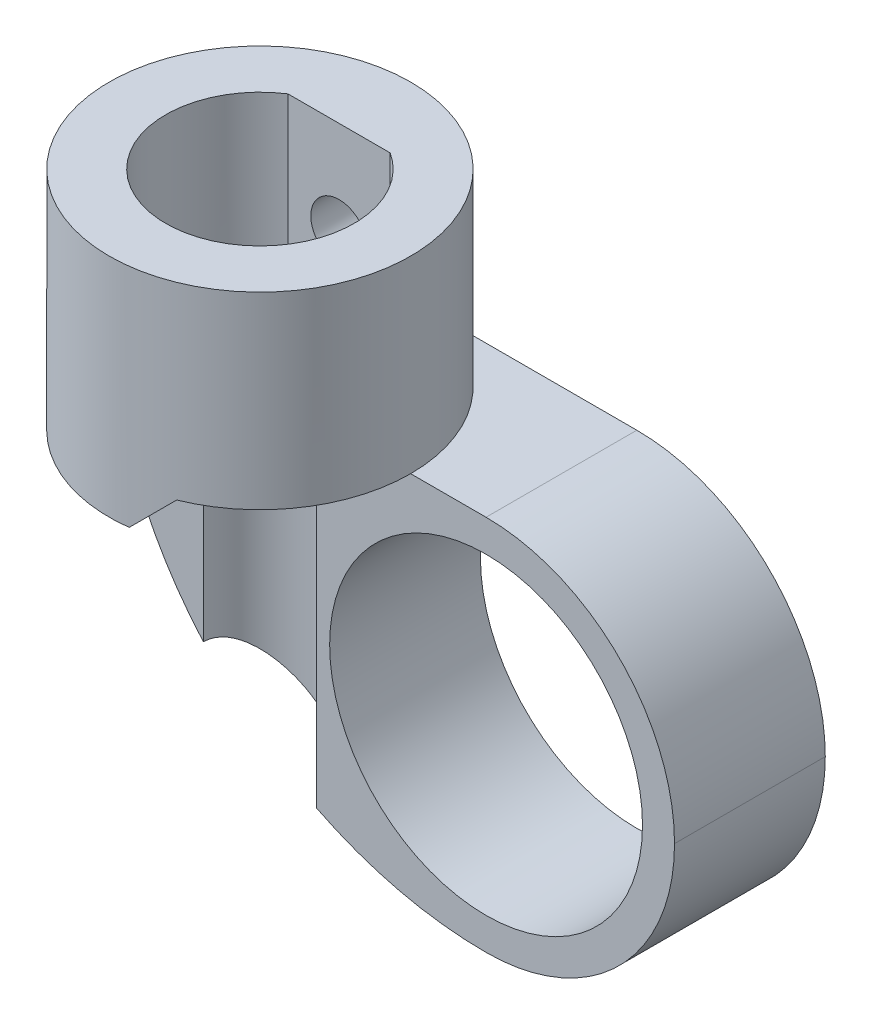
ISO-10303-21;
HEADER;
FILE_DESCRIPTION(('STEP AP214'),'2;1');
FILE_NAME('part.step','',(''),(''),'','','');
FILE_SCHEMA(('AUTOMOTIVE_DESIGN { 1 0 10303 214 1 1 1 1 }'));
ENDSEC;
DATA;
#1=APPLICATION_CONTEXT('core data for automotive mechanical design processes');
#2=APPLICATION_PROTOCOL_DEFINITION('international standard','automotive_design',2000,#1);
#3=PRODUCT_CONTEXT('',#1,'mechanical');
#4=PRODUCT('Part','Part','',(#3));
#5=PRODUCT_RELATED_PRODUCT_CATEGORY('part','',(#4));
#6=PRODUCT_DEFINITION_FORMATION('','',#4);
#7=PRODUCT_DEFINITION_CONTEXT('part definition',#1,'design');
#8=PRODUCT_DEFINITION('design','',#6,#7);
#9=PRODUCT_DEFINITION_SHAPE('','',#8);
#10=(LENGTH_UNIT() NAMED_UNIT(*) SI_UNIT(.MILLI.,.METRE.));
#11=(NAMED_UNIT(*) PLANE_ANGLE_UNIT() SI_UNIT($,.RADIAN.));
#12=(NAMED_UNIT(*) SI_UNIT($,.STERADIAN.) SOLID_ANGLE_UNIT());
#13=UNCERTAINTY_MEASURE_WITH_UNIT(LENGTH_MEASURE(1.E-05),#10,'distance_accuracy_value','');
#14=(GEOMETRIC_REPRESENTATION_CONTEXT(3) GLOBAL_UNCERTAINTY_ASSIGNED_CONTEXT((#13)) GLOBAL_UNIT_ASSIGNED_CONTEXT((#10,
#11,#12)) REPRESENTATION_CONTEXT('',''));
#15=CARTESIAN_POINT('',(0.,0.,0.));
#16=DIRECTION('',(0.,0.,1.));
#17=DIRECTION('',(1.,0.,0.));
#18=AXIS2_PLACEMENT_3D('',#15,#16,#17);
#19=CARTESIAN_POINT('',(0.,6.,0.));
#20=DIRECTION('',(0.,-1.,0.));
#21=DIRECTION('',(0.,0.,-1.));
#22=AXIS2_PLACEMENT_3D('',#19,#20,#21);
#23=CYLINDRICAL_SURFACE('',#22,4.);
#24=CARTESIAN_POINT('',(0.,-6.,0.));
#25=DIRECTION('',(0.,1.,0.));
#26=DIRECTION('',(0.,0.,1.));
#27=AXIS2_PLACEMENT_3D('',#24,#25,#26);
#28=CIRCLE('',#27,4.);
#29=CARTESIAN_POINT('',(-3.9498743710662,-6.,0.631262586246322));
#30=VERTEX_POINT('',#29);
#31=CARTESIAN_POINT('',(0.499999999999999,-6.,3.96862696659689));
#32=VERTEX_POINT('',#31);
#33=EDGE_CURVE('E193',#30,#32,#28,.T.);
#34=ORIENTED_EDGE('',*,*,#33,.T.);
#35=CARTESIAN_POINT('',(0.,-6.5,0.));
#36=DIRECTION('',(0.707106781186546,-0.707106781186549,0.));
#37=DIRECTION('',(-0.707106781186549,-0.707106781186546,0.));
#38=AXIS2_PLACEMENT_3D('',#35,#36,#37);
#39=ELLIPSE('',#38,5.65685424949237,4.);
#40=CARTESIAN_POINT('',(1.5,-5.,3.70809924354783));
#41=VERTEX_POINT('',#40);
#42=EDGE_CURVE('E11',#32,#41,#39,.F.);
#43=ORIENTED_EDGE('',*,*,#42,.T.);
#44=CARTESIAN_POINT('',(0.,-5.,0.));
#45=DIRECTION('',(0.,1.,0.));
#46=DIRECTION('',(0.,0.,1.));
#47=AXIS2_PLACEMENT_3D('',#44,#45,#46);
#48=CIRCLE('',#47,4.);
#49=CARTESIAN_POINT('',(4.,-5.,0.));
#50=VERTEX_POINT('',#49);
#51=EDGE_CURVE('E140',#41,#50,#48,.T.);
#52=ORIENTED_EDGE('',*,*,#51,.T.);
#53=CARTESIAN_POINT('',(0.,-5.,0.));
#54=DIRECTION('',(0.,1.,0.));
#55=DIRECTION('',(-1.,0.,0.));
#56=AXIS2_PLACEMENT_3D('',#53,#54,#55);
#57=CIRCLE('',#56,4.);
#58=CARTESIAN_POINT('',(0.,-5.,-4.));
#59=VERTEX_POINT('',#58);
#60=EDGE_CURVE('E153',#50,#59,#57,.T.);
#61=ORIENTED_EDGE('',*,*,#60,.T.);
#62=DIRECTION('',(0.,1.,0.));
#63=VECTOR('',#62,1.);
#64=CARTESIAN_POINT('',(0.,-15.,-4.));
#65=LINE('',#64,#63);
#66=CARTESIAN_POINT('',(0.,-13.,-4.));
#67=VERTEX_POINT('',#66);
#68=EDGE_CURVE('E338',#67,#59,#65,.T.);
#69=ORIENTED_EDGE('',*,*,#68,.F.);
#70=CARTESIAN_POINT('',(0.,-13.,-4.));
#71=CARTESIAN_POINT('',(-0.136828142349664,-12.8974163205105,-3.9999865045483));
#72=CARTESIAN_POINT('',(-0.270883349009088,-12.7913558223817,-3.99298316514078));
#73=CARTESIAN_POINT('',(-0.532473742800878,-12.573345536025,-3.96657821674277));
#74=CARTESIAN_POINT('',(-0.660019795246987,-12.4614062401594,-3.9471980508367));
#75=CARTESIAN_POINT('',(-0.906916734491149,-12.2334307682533,-3.89784569202083));
#76=CARTESIAN_POINT('',(-1.02633399292208,-12.1174436459312,-3.86797592672533));
#77=CARTESIAN_POINT('',(-1.2579962205929,-11.8810530718573,-3.79895536855165));
#78=CARTESIAN_POINT('',(-1.37023693747521,-11.7606470670557,-3.75979913664154));
#79=CARTESIAN_POINT('',(-1.63335273219341,-11.4642196545002,-3.65511218402422));
#80=CARTESIAN_POINT('',(-1.78042089668579,-11.2862713975695,-3.58543920262987));
#81=CARTESIAN_POINT('',(-2.05941788108904,-10.9243595245275,-3.43279691235437));
#82=CARTESIAN_POINT('',(-2.19134288412687,-10.7403944067991,-3.3498242638316));
#83=CARTESIAN_POINT('',(-2.44098896225458,-10.3666096422533,-3.17256045263293));
#84=CARTESIAN_POINT('',(-2.55862453171194,-10.1767625402299,-3.07820730054449));
#85=CARTESIAN_POINT('',(-2.77917552112438,-9.79322689449994,-2.880642470672));
#86=CARTESIAN_POINT('',(-2.88209066491544,-9.59953827880181,-2.77743062675168));
#87=CARTESIAN_POINT('',(-3.11335424297583,-9.12812428449467,-2.51956723914358));
#88=CARTESIAN_POINT('',(-3.23456273387307,-8.84884356889938,-2.36132688702443));
#89=CARTESIAN_POINT('',(-3.44956780619618,-8.28580891102368,-2.03439818807636));
#90=CARTESIAN_POINT('',(-3.543350883079,-8.00205283726669,-1.86570474342132));
#91=CARTESIAN_POINT('',(-3.70425021344949,-7.43208484915114,-1.52137047053106));
#92=CARTESIAN_POINT('',(-3.77141934042668,-7.14587896988863,-1.34574418718945));
#93=CARTESIAN_POINT('',(-3.88003973098983,-6.57166812426913,-0.989887224920112));
#94=CARTESIAN_POINT('',(-3.92150459798406,-6.28366419115203,-0.809659034125396));
#95=CARTESIAN_POINT('',(-3.96664690227575,-5.83231316445596,-0.525804465514071));
#96=CARTESIAN_POINT('',(-3.97891607459805,-5.66926692083749,-0.422978469644738));
#97=CARTESIAN_POINT('',(-3.99544488881155,-5.34310856296169,-0.216995930114276));
#98=CARTESIAN_POINT('',(-3.99971005306622,-5.1799965718407,-0.113839663582865));
#99=CARTESIAN_POINT('',(-3.99999523753145,-5.01126870148945,-0.00712695256115777));
#100=CARTESIAN_POINT('',(-3.99999999934633,-5.00563433748219,-0.00356346779445506));
#101=CARTESIAN_POINT('',(-4.,-4.99999999999999,0.));
#102=B_SPLINE_CURVE_WITH_KNOTS('',3,(#70,#71,#72,#73,#74,#75,#76,#77,#78,#79,#80,#81,#82,#83,
#84,#85,#86,#87,#88,#89,#90,#91,#92,#93,#94,#95,#96,#97,#98,#99,#100,#101),.UNSPECIFIED.,.F.,
.F.,(4,2,2,2,2,2,2,2,2,2,2,2,2,2,2,4),(0.,0.51264684022408,1.02440791078158,1.53130471589305,
2.03849914404044,2.76083094309587,3.48334440980876,4.20998802285531,4.93664526638483,
5.96450394794212,6.99286790824439,8.01917846622402,9.04494540740962,9.62426733753745,
10.2031894174716,10.2231894225741),.UNSPECIFIED.);
#103=CARTESIAN_POINT('',(-4.,-5.,0.));
#104=VERTEX_POINT('',#103);
#105=EDGE_CURVE('E233',#104,#67,#102,.F.);
#106=ORIENTED_EDGE('',*,*,#105,.F.);
#107=CARTESIAN_POINT('',(-3.9498743710662,-6.,0.631262586246322));
#108=CARTESIAN_POINT('',(-3.96632277253755,-5.83630392232504,0.528319356862076));
#109=CARTESIAN_POINT('',(-3.97871575402529,-5.6724313521736,0.424975405116242));
#110=CARTESIAN_POINT('',(-3.99540519007638,-5.34466869147848,0.217982730391227));
#111=CARTESIAN_POINT('',(-3.99970877436979,-5.18077874380115,0.114334356507498));
#112=CARTESIAN_POINT('',(-3.99999523603248,-5.01126870686564,0.00712695582297904));
#113=CARTESIAN_POINT('',(-3.99999999779557,-5.00563434305114,0.00356347116541063));
#114=CARTESIAN_POINT('',(-4.,-5.,0.));
#115=B_SPLINE_CURVE_WITH_KNOTS('',3,(#107,#108,#109,#110,#111,#112,#113,#114),.UNSPECIFIED.,.F.,
.F.,(4,2,2,4),(0.,0.582212443825409,1.16391150360277,1.18391150870536),.UNSPECIFIED.);
#116=EDGE_CURVE('E210',#104,#30,#115,.F.);
#117=ORIENTED_EDGE('',*,*,#116,.T.);
#118=EDGE_LOOP('',(#34,#43,#52,#61,#69,#106,#117));
#119=FACE_BOUND('',#118,.T.);
#120=CARTESIAN_POINT('',(0.,-1.75,-4.));
#121=CARTESIAN_POINT('',(-0.0417358732327354,-1.75000159479414,-3.99999924416926));
#122=CARTESIAN_POINT('',(-0.0834924963650492,-1.75349553830969,-3.99934004960857));
#123=CARTESIAN_POINT('',(-0.165829064920899,-1.76736999755917,-3.9967739294526));
#124=CARTESIAN_POINT('',(-0.206407987076113,-1.77775632531987,-3.99486595083448));
#125=CARTESIAN_POINT('',(-0.2851864809259,-1.80508635062967,-3.99001569382729));
#126=CARTESIAN_POINT('',(-0.323388165342672,-1.82202412622627,-3.98707434973241));
#127=CARTESIAN_POINT('',(-0.396403986547003,-1.86195943846141,-3.98047855299892));
#128=CARTESIAN_POINT('',(-0.431218397238661,-1.88495648457241,-3.97682415809145));
#129=CARTESIAN_POINT('',(-0.496891857965251,-1.93664988400184,-3.96915668215252));
#130=CARTESIAN_POINT('',(-0.527704477515916,-1.96540472233507,-3.96514017428176));
#131=CARTESIAN_POINT('',(-0.584098030676846,-2.02767165454378,-3.95722659229325));
#132=CARTESIAN_POINT('',(-0.609678588446207,-2.06118408988464,-3.95332952677264));
#133=CARTESIAN_POINT('',(-0.655074993328963,-2.13234304418199,-3.94606275622503));
#134=CARTESIAN_POINT('',(-0.674843609848025,-2.17002018515862,-3.94269746943091));
#135=CARTESIAN_POINT('',(-0.707752621661414,-2.2482344575884,-3.93692356605994));
#136=CARTESIAN_POINT('',(-0.72089358856549,-2.28877134205561,-3.93451486698481));
#137=CARTESIAN_POINT('',(-0.740025267517499,-2.37105761545721,-3.93096134787275));
#138=CARTESIAN_POINT('',(-0.746096950960194,-2.41278754860173,-3.92980222683202));
#139=CARTESIAN_POINT('',(-0.75116904047673,-2.49668869240413,-3.92883598576381));
#140=CARTESIAN_POINT('',(-0.750170080676868,-2.53885986315115,-3.9290287444938));
#141=CARTESIAN_POINT('',(-0.74119489801181,-2.62185976263303,-3.93073146350876));
#142=CARTESIAN_POINT('',(-0.733310749980222,-2.66269885715008,-3.93222404073667));
#143=CARTESIAN_POINT('',(-0.710933996981033,-2.74246420989131,-3.93633091642333));
#144=CARTESIAN_POINT('',(-0.696441111197494,-2.78139038675465,-3.93894526254758));
#145=CARTESIAN_POINT('',(-0.661168235896496,-2.85649433950013,-3.94501927646294));
#146=CARTESIAN_POINT('',(-0.640351067662276,-2.89265423529041,-3.94848391911683));
#147=CARTESIAN_POINT('',(-0.593046844652078,-2.96100236427012,-3.95586485801459));
#148=CARTESIAN_POINT('',(-0.566559214446327,-2.9931901938574,-3.95978120007761));
#149=CARTESIAN_POINT('',(-0.508169528426486,-3.05321247783623,-3.96770000636082));
#150=CARTESIAN_POINT('',(-0.476188718430338,-3.08097032622587,-3.97170285512015));
#151=CARTESIAN_POINT('',(-0.40798401854941,-3.1307386203377,-3.97928693054159));
#152=CARTESIAN_POINT('',(-0.371760086127881,-3.15274900843521,-3.98286815297623));
#153=CARTESIAN_POINT('',(-0.296017494437331,-3.19040887693501,-3.98921269838754));
#154=CARTESIAN_POINT('',(-0.256494782223244,-3.20605038955895,-3.99197499568144));
#155=CARTESIAN_POINT('',(-0.175319557699345,-3.23045104654608,-3.9963625270136));
#156=CARTESIAN_POINT('',(-0.13366727213889,-3.23921092202268,-3.99798788183997));
#157=CARTESIAN_POINT('',(-0.0500743264516893,-3.24949301550914,-3.9999018032099));
#158=CARTESIAN_POINT('',(-0.00814700631706428,-3.25112019576486,-4.00020975456139));
#159=CARTESIAN_POINT('',(0.0753806240460953,-3.24737226022618,-3.99950771799114));
#160=CARTESIAN_POINT('',(0.116980950240196,-3.24199748846737,-3.99849779482216));
#161=CARTESIAN_POINT('',(0.198340786609112,-3.22448548240832,-3.99528555750203));
#162=CARTESIAN_POINT('',(0.238112130523035,-3.21240135873109,-3.99309261187015));
#163=CARTESIAN_POINT('',(0.315064315912319,-3.18187114661061,-3.98775921106249));
#164=CARTESIAN_POINT('',(0.352244981297554,-3.16342462621711,-3.98461869155667));
#165=CARTESIAN_POINT('',(0.42340833575661,-3.12046093592024,-3.97769015178833));
#166=CARTESIAN_POINT('',(0.457351638507563,-3.09587963073158,-3.97389543087281));
#167=CARTESIAN_POINT('',(0.520669161632275,-3.04143093131882,-3.96609671744856));
#168=CARTESIAN_POINT('',(0.550042954880436,-3.01156304349933,-3.96209270542343));
#169=CARTESIAN_POINT('',(0.603786479360242,-2.94691384054429,-3.95426237848725));
#170=CARTESIAN_POINT('',(0.628084581092885,-2.91207254593731,-3.95043912930128));
#171=CARTESIAN_POINT('',(0.670483375288937,-2.83874118773812,-3.94346492789266));
#172=CARTESIAN_POINT('',(0.688584298069623,-2.80025125981476,-3.94031395068675));
#173=CARTESIAN_POINT('',(0.717973367564117,-2.72089706637873,-3.93506512104787));
#174=CARTESIAN_POINT('',(0.729294343973933,-2.68004531022033,-3.93296220218439));
#175=CARTESIAN_POINT('',(0.744903396631179,-2.5969763887393,-3.93003601901208));
#176=CARTESIAN_POINT('',(0.749192266353543,-2.5547593780148,-3.92921261032895));
#177=CARTESIAN_POINT('',(0.750588810741775,-2.47087583427924,-3.92894599901929));
#178=CARTESIAN_POINT('',(0.747809475017496,-2.4292112095215,-3.92948107987147));
#179=CARTESIAN_POINT('',(0.735395876894016,-2.34695428897735,-3.93182300329999));
#180=CARTESIAN_POINT('',(0.725761655446661,-2.30636198678628,-3.93362983827873));
#181=CARTESIAN_POINT('',(0.699959437916317,-2.22746275760226,-3.9383025401159));
#182=CARTESIAN_POINT('',(0.683803676986263,-2.18915170432711,-3.94116642297482));
#183=CARTESIAN_POINT('',(0.645429344561022,-2.11576587287958,-3.9476319377592));
#184=CARTESIAN_POINT('',(0.623210344740929,-2.08069132357761,-3.9512336218006));
#185=CARTESIAN_POINT('',(0.572947436697676,-2.01420815997885,-3.95883633053873));
#186=CARTESIAN_POINT('',(0.544821299321518,-1.98286229371645,-3.96284252676522));
#187=CARTESIAN_POINT('',(0.483713963371146,-1.92529741876774,-3.97076416959367));
#188=CARTESIAN_POINT('',(0.450731650945808,-1.89907958950993,-3.97467959513664));
#189=CARTESIAN_POINT('',(0.380492472535937,-1.85229452368647,-3.98201987984024));
#190=CARTESIAN_POINT('',(0.343199795320258,-1.83178028575468,-3.9854400049528));
#191=CARTESIAN_POINT('',(0.265645056826917,-1.79734118169743,-3.99135809690343));
#192=CARTESIAN_POINT('',(0.225385825852624,-1.78341012647655,-3.99385692939519));
#193=CARTESIAN_POINT('',(0.154173601412577,-1.76536134279066,-3.99714145353816));
#194=CARTESIAN_POINT('',(0.123636905125935,-1.7596106848436,-3.99820735439103));
#195=CARTESIAN_POINT('',(0.0620706235575788,-1.75192946894178,-3.99963689977005));
#196=CARTESIAN_POINT('',(0.0310410508263547,-1.74999881387205,-4.00000056214902));
#197=CARTESIAN_POINT('',(0.,-1.75,-4.));
#198=B_SPLINE_CURVE_WITH_KNOTS('',3,(#120,#121,#122,#123,#124,#125,#126,#127,#128,#129,#130,
#131,#132,#133,#134,#135,#136,#137,#138,#139,#140,#141,#142,#143,#144,#145,#146,#147,#148,#149,
#150,#151,#152,#153,#154,#155,#156,#157,#158,#159,#160,#161,#162,#163,#164,#165,#166,#167,#168,
#169,#170,#171,#172,#173,#174,#175,#176,#177,#178,#179,#180,#181,#182,#183,#184,#185,#186,#187,
#188,#189,#190,#191,#192,#193,#194,#195,#196,#197),.UNSPECIFIED.,.T.,.F.,(4,2,2,2,2,2,2,2,2,2,2,
2,2,2,2,2,2,2,2,2,2,2,2,2,2,2,2,2,2,2,2,2,2,2,2,2,2,2,4),(0.,0.125094100482462,
0.250293821267726,0.375380635615453,0.500457326684453,0.626875590068152,0.753302931418083,
0.880730952521787,1.00814798155974,1.13409075722668,1.26002223793628,1.38429500306383,
1.50857304923393,1.63359631314765,1.7586322702493,1.88563884232038,2.01264668772474,
2.13981294160849,2.26696568336873,2.39224087038048,2.51750990232292,2.64180116953914,
2.76610087669016,2.89175889008854,3.01742864206549,3.14476718493649,3.27210099477472,
3.39881313909279,3.52551098473256,3.65019626115874,3.77488079270753,3.89933248103846,
4.02379296327711,4.1501168498319,4.27646975631128,4.40396024458157,4.53133063465587,
4.62437172262205,4.7174104451977),.UNSPECIFIED.);
#199=CARTESIAN_POINT('',(0.,-1.75,-4.));
#200=VERTEX_POINT('',#199);
#201=EDGE_CURVE('E288',#200,#200,#198,.T.);
#202=ORIENTED_EDGE('',*,*,#201,.T.);
#203=EDGE_LOOP('',(#202));
#204=FACE_BOUND('',#203,.T.);
#205=CARTESIAN_POINT('',(0.,0.,0.));
#206=DIRECTION('',(0.,1.,0.));
#207=DIRECTION('',(0.,0.,1.));
#208=AXIS2_PLACEMENT_3D('',#205,#206,#207);
#209=CIRCLE('',#208,4.);
#210=CARTESIAN_POINT('',(0.,0.,4.));
#211=VERTEX_POINT('',#210);
#212=EDGE_CURVE('E284',#211,#211,#209,.T.);
#213=ORIENTED_EDGE('',*,*,#212,.F.);
#214=EDGE_LOOP('',(#213));
#215=FACE_BOUND('',#214,.T.);
#216=ADVANCED_FACE('F38',(#119,#204,#215),#23,.T.);
#217=CARTESIAN_POINT('',(0.,6.,0.));
#218=DIRECTION('',(0.,-1.,0.));
#219=DIRECTION('',(0.,0.,-1.));
#220=AXIS2_PLACEMENT_3D('',#217,#218,#219);
#221=CYLINDRICAL_SURFACE('',#220,2.5);
#222=CARTESIAN_POINT('',(0.,-5.,0.));
#223=DIRECTION('',(0.,1.,0.));
#224=DIRECTION('',(0.,0.,1.));
#225=AXIS2_PLACEMENT_3D('',#222,#223,#224);
#226=CIRCLE('',#225,2.5);
#227=CARTESIAN_POINT('',(1.5,-5.,2.));
#228=VERTEX_POINT('',#227);
#229=CARTESIAN_POINT('',(2.5,-5.,0.));
#230=VERTEX_POINT('',#229);
#231=EDGE_CURVE('E142',#228,#230,#226,.T.);
#232=ORIENTED_EDGE('',*,*,#231,.F.);
#233=CARTESIAN_POINT('',(0.,-6.5,0.));
#234=DIRECTION('',(0.707106781186546,-0.707106781186549,0.));
#235=DIRECTION('',(-0.707106781186549,-0.707106781186546,0.));
#236=AXIS2_PLACEMENT_3D('',#233,#234,#235);
#237=ELLIPSE('',#236,3.53553390593273,2.5);
#238=CARTESIAN_POINT('',(0.499999999999999,-6.,2.44948974278318));
#239=VERTEX_POINT('',#238);
#240=EDGE_CURVE('E60',#228,#239,#237,.T.);
#241=ORIENTED_EDGE('',*,*,#240,.T.);
#242=CARTESIAN_POINT('',(0.,-6.,0.));
#243=DIRECTION('',(0.,1.,0.));
#244=DIRECTION('',(0.,0.,1.));
#245=AXIS2_PLACEMENT_3D('',#242,#243,#244);
#246=CIRCLE('',#245,2.5);
#247=CARTESIAN_POINT('',(-2.5,-6.,0.));
#248=VERTEX_POINT('',#247);
#249=EDGE_CURVE('E166',#248,#239,#246,.T.);
#250=ORIENTED_EDGE('',*,*,#249,.F.);
#251=DIRECTION('',(0.,-1.,0.));
#252=VECTOR('',#251,1.);
#253=CARTESIAN_POINT('',(-2.5,6.,0.));
#254=LINE('',#253,#252);
#255=CARTESIAN_POINT('',(-2.5,-5.,0.));
#256=VERTEX_POINT('',#255);
#257=EDGE_CURVE('E180',#256,#248,#254,.T.);
#258=ORIENTED_EDGE('',*,*,#257,.F.);
#259=CARTESIAN_POINT('',(0.,-5.,0.));
#260=DIRECTION('',(0.,1.,0.));
#261=DIRECTION('',(-1.,0.,0.));
#262=AXIS2_PLACEMENT_3D('',#259,#260,#261);
#263=CIRCLE('',#262,2.5);
#264=CARTESIAN_POINT('',(-1.35646599662505,-5.,-2.1));
#265=VERTEX_POINT('',#264);
#266=EDGE_CURVE('E186',#265,#256,#263,.T.);
#267=ORIENTED_EDGE('',*,*,#266,.F.);
#268=DIRECTION('',(0.,-1.,0.));
#269=VECTOR('',#268,1.);
#270=CARTESIAN_POINT('',(-1.35646599662505,6.,-2.1));
#271=LINE('',#270,#269);
#272=CARTESIAN_POINT('',(-1.35646599662505,0.,-2.1));
#273=VERTEX_POINT('',#272);
#274=EDGE_CURVE('E195',#273,#265,#271,.T.);
#275=ORIENTED_EDGE('',*,*,#274,.F.);
#276=CARTESIAN_POINT('',(0.,0.,0.));
#277=DIRECTION('',(0.,1.,0.));
#278=DIRECTION('',(0.,0.,1.));
#279=AXIS2_PLACEMENT_3D('',#276,#277,#278);
#280=CIRCLE('',#279,2.5);
#281=CARTESIAN_POINT('',(1.35646599662505,0.,-2.1));
#282=VERTEX_POINT('',#281);
#283=EDGE_CURVE('E156',#273,#282,#280,.T.);
#284=ORIENTED_EDGE('',*,*,#283,.T.);
#285=DIRECTION('',(0.,-1.,0.));
#286=VECTOR('',#285,1.);
#287=CARTESIAN_POINT('',(1.35646599662505,6.,-2.1));
#288=LINE('',#287,#286);
#289=CARTESIAN_POINT('',(1.35646599662505,-5.,-2.1));
#290=VERTEX_POINT('',#289);
#291=EDGE_CURVE('E197',#282,#290,#288,.T.);
#292=ORIENTED_EDGE('',*,*,#291,.T.);
#293=EDGE_CURVE('E167',#230,#290,#263,.T.);
#294=ORIENTED_EDGE('',*,*,#293,.F.);
#295=EDGE_LOOP('',(#232,#241,#250,#258,#267,#275,#284,#292,#294));
#296=FACE_BOUND('',#295,.T.);
#297=ADVANCED_FACE('F271',(#296),#221,.F.);
#298=CARTESIAN_POINT('',(-1.35646599662505,6.,-2.1));
#299=DIRECTION('',(0.,0.,1.));
#300=DIRECTION('',(1.,0.,0.));
#301=AXIS2_PLACEMENT_3D('',#298,#299,#300);
#302=PLANE('',#301);
#303=CARTESIAN_POINT('',(0.,-2.5,-2.1));
#304=DIRECTION('',(0.,0.,1.));
#305=DIRECTION('',(1.,0.,0.));
#306=AXIS2_PLACEMENT_3D('',#303,#304,#305);
#307=CIRCLE('',#306,0.75);
#308=CARTESIAN_POINT('',(0.750000000000002,-2.5,-2.1));
#309=VERTEX_POINT('',#308);
#310=EDGE_CURVE('E287',#309,#309,#307,.T.);
#311=ORIENTED_EDGE('',*,*,#310,.F.);
#312=EDGE_LOOP('',(#311));
#313=FACE_BOUND('',#312,.T.);
#314=ORIENTED_EDGE('',*,*,#291,.F.);
#315=DIRECTION('',(-1.,0.,0.));
#316=VECTOR('',#315,1.);
#317=CARTESIAN_POINT('',(-1.35646599662505,0.,-2.1));
#318=LINE('',#317,#316);
#319=EDGE_CURVE('E312',#282,#273,#318,.T.);
#320=ORIENTED_EDGE('',*,*,#319,.T.);
#321=ORIENTED_EDGE('',*,*,#274,.T.);
#322=DIRECTION('',(-1.,0.,0.));
#323=VECTOR('',#322,1.);
#324=CARTESIAN_POINT('',(-1.35646599662505,-5.,-2.1));
#325=LINE('',#324,#323);
#326=EDGE_CURVE('E201',#290,#265,#325,.T.);
#327=ORIENTED_EDGE('',*,*,#326,.F.);
#328=EDGE_LOOP('',(#314,#320,#321,#327));
#329=FACE_BOUND('',#328,.T.);
#330=ADVANCED_FACE('F226',(#313,#329),#302,.T.);
#331=CARTESIAN_POINT('',(6.,-5.,0.));
#332=DIRECTION('',(0.,0.,-1.));
#333=DIRECTION('',(-1.,0.,0.));
#334=AXIS2_PLACEMENT_3D('',#331,#332,#333);
#335=CYLINDRICAL_SURFACE('',#334,10.);
#336=CARTESIAN_POINT('',(6.,-5.,0.));
#337=DIRECTION('',(0.,0.,1.));
#338=DIRECTION('',(1.,0.,0.));
#339=AXIS2_PLACEMENT_3D('',#336,#337,#338);
#340=CIRCLE('',#339,10.);
#341=CARTESIAN_POINT('',(1.5,-13.9302855497459,0.));
#342=VERTEX_POINT('',#341);
#343=CARTESIAN_POINT('',(6.,-15.,0.));
#344=VERTEX_POINT('',#343);
#345=EDGE_CURVE('E330',#342,#344,#340,.T.);
#346=ORIENTED_EDGE('',*,*,#345,.F.);
#347=CARTESIAN_POINT('',(1.34746164482671,-13.8517730909486,0.6590501617638));
#348=CARTESIAN_POINT('',(1.3638405116231,-13.8603813325651,0.625564840930619));
#349=CARTESIAN_POINT('',(1.37903094565329,-13.8683081873461,0.591339740046965));
#350=CARTESIAN_POINT('',(1.40689568320122,-13.8827721154699,0.521590095588166));
#351=CARTESIAN_POINT('',(1.41956957834198,-13.8893089632583,0.48606534221489));
#352=CARTESIAN_POINT('',(1.4535763030817,-13.9067779014724,0.377904141559826));
#353=CARTESIAN_POINT('',(1.47092907625937,-13.9155865377174,0.303609816576838));
#354=CARTESIAN_POINT('',(1.49416280403399,-13.9273514287829,0.152712631322223));
#355=CARTESIAN_POINT('',(1.50002680356005,-13.9302990340205,0.0761065282530577));
#356=CARTESIAN_POINT('',(1.49997304442522,-13.9302719888573,-0.0770649858226824));
#357=CARTESIAN_POINT('',(1.49406232329962,-13.9273008759661,-0.153630393793785));
#358=CARTESIAN_POINT('',(1.47092450436669,-13.9155839006488,-0.303375463870463));
#359=CARTESIAN_POINT('',(1.45386908302581,-13.9069256345366,-0.376588741659311));
#360=CARTESIAN_POINT('',(1.40936829351503,-13.8840712110905,-0.518884165085727));
#361=CARTESIAN_POINT('',(1.38191973699341,-13.8698733543091,-0.58796503546667));
#362=CARTESIAN_POINT('',(1.31709739442015,-13.8358239771667,-0.721733064110309));
#363=CARTESIAN_POINT('',(1.27952035810275,-13.815855997639,-0.786291673155558));
#364=CARTESIAN_POINT('',(1.19628088037985,-13.7707763678961,-0.907936242062397));
#365=CARTESIAN_POINT('',(1.1506175085304,-13.7456641257106,-0.965021340677869));
#366=CARTESIAN_POINT('',(1.04946109432198,-13.6888291178425,-1.07450786534398));
#367=CARTESIAN_POINT('',(0.993503991721032,-13.6567669050913,-1.12630269767511));
#368=CARTESIAN_POINT('',(0.876293766843078,-13.587913508091,-1.21972721454446));
#369=CARTESIAN_POINT('',(0.81503845355598,-13.5511203643332,-1.26135266618283));
#370=CARTESIAN_POINT('',(0.681637915650917,-13.4688757099594,-1.3386538387066));
#371=CARTESIAN_POINT('',(0.609062185445553,-13.4229148378917,-1.37304093313891));
#372=CARTESIAN_POINT('',(0.4618488766851,-13.326861728027,-1.42930620964578));
#373=CARTESIAN_POINT('',(0.387210135241651,-13.2767671271675,-1.45117717934804));
#374=CARTESIAN_POINT('',(0.225687868423969,-13.1650732159126,-1.48557361369924));
#375=CARTESIAN_POINT('',(0.138754801294888,-13.1029151353558,-1.4960454855704));
#376=CARTESIAN_POINT('',(-0.0333579396957669,-12.9755927617855,-1.50210252788695));
#377=CARTESIAN_POINT('',(-0.118537015386521,-12.9104274669843,-1.49768270166098));
#378=CARTESIAN_POINT('',(-0.299831234289433,-12.7670867759099,-1.47303689896065));
#379=CARTESIAN_POINT('',(-0.395340777913141,-12.6885844905904,-1.45024918710588));
#380=CARTESIAN_POINT('',(-0.580137003177532,-12.5310402224312,-1.38672863818358));
#381=CARTESIAN_POINT('',(-0.669409388341068,-12.4519974280371,-1.34595604567742));
#382=CARTESIAN_POINT('',(-0.801499391230942,-12.3310083582613,-1.26907393092066));
#383=CARTESIAN_POINT('',(-0.84722058428704,-12.288297829637,-1.23904986278232));
#384=CARTESIAN_POINT('',(-0.935791953653435,-12.204064482784,-1.17359729193887));
#385=CARTESIAN_POINT('',(-0.978641014089007,-12.1625421297322,-1.13816670602169));
#386=CARTESIAN_POINT('',(-1.10200668297465,-12.0409252370373,-1.02378064254746));
#387=CARTESIAN_POINT('',(-1.17781524722301,-11.9633426524102,-0.936462480403114));
#388=CARTESIAN_POINT('',(-1.27959588574806,-11.8563964844042,-0.785246576625852));
#389=CARTESIAN_POINT('',(-1.31224189211468,-11.8215115458555,-0.729638322179554));
#390=CARTESIAN_POINT('',(-1.37110401927696,-11.7578607855749,-0.611873797207136));
#391=CARTESIAN_POINT('',(-1.39733079117271,-11.7290848381842,-0.549728621468217));
#392=CARTESIAN_POINT('',(-1.43806621328417,-11.6840066019807,-0.430402414173734));
#393=CARTESIAN_POINT('',(-1.45380146216058,-11.6664226702859,-0.374131495579732));
#394=CARTESIAN_POINT('',(-1.47875157644145,-11.6384207995902,-0.258428929397664));
#395=CARTESIAN_POINT('',(-1.48797169842714,-11.6279970837226,-0.198999871607028));
#396=CARTESIAN_POINT('',(-1.4991882239485,-11.615304525885,-0.078264722906554));
#397=CARTESIAN_POINT('',(-1.50114741051731,-11.6130776986379,-0.0169505812474339));
#398=CARTESIAN_POINT('',(-1.49755513131625,-11.6171498905275,0.10517226659443));
#399=CARTESIAN_POINT('',(-1.49200262825413,-11.6234500871644,0.165980901804825));
#400=CARTESIAN_POINT('',(-1.47460005721933,-11.643079469218,0.280437638032029));
#401=CARTESIAN_POINT('',(-1.46327950406945,-11.6558170042626,0.334272809041047));
#402=CARTESIAN_POINT('',(-1.43539789164464,-11.6869492702616,0.438817972243967));
#403=CARTESIAN_POINT('',(-1.41883571026675,-11.7053452125173,0.489527292490813));
#404=CARTESIAN_POINT('',(-1.38405093706975,-11.7436162106605,0.579997944482545));
#405=CARTESIAN_POINT('',(-1.36644526487725,-11.7628605479102,0.620263576101669));
#406=CARTESIAN_POINT('',(-1.34746164482696,-11.7834215096659,0.659050161763975));
#407=B_SPLINE_CURVE_WITH_KNOTS('',3,(#347,#348,#349,#350,#351,#352,#353,#354,#355,#356,#357,
#358,#359,#360,#361,#362,#363,#364,#365,#366,#367,#368,#369,#370,#371,#372,#373,#374,#375,#376,
#377,#378,#379,#380,#381,#382,#383,#384,#385,#386,#387,#388,#389,#390,#391,#392,#393,#394,#395,
#396,#397,#398,#399,#400,#401,#402,#403,#404,#405,#406),.UNSPECIFIED.,.F.,.F.,(4,2,2,2,2,2,2,2,
2,2,2,2,2,2,2,2,2,2,2,2,2,2,2,2,2,2,2,2,2,4),(0.,0.114709618972654,0.229437837519416,
0.458653941516657,0.688208067364548,0.91762503407138,1.14358875241326,1.3696218469614,
1.6005805185918,1.83156578247744,2.07870214396388,2.32594119881754,2.60246351487343,
2.87914501589136,3.20006872452014,3.521100124694,3.89676124439124,4.27325695424998,
4.48118555353998,4.68919447408035,5.10314348094217,5.32247646393463,5.54144301379954,
5.72375965906545,5.90592903783353,6.08903087062073,6.2721579905947,6.44088562180477,
6.60964939788784,6.75322079915278),.UNSPECIFIED.);
#408=CARTESIAN_POINT('',(-1.5,-11.6143782776615,0.));
#409=VERTEX_POINT('',#408);
#410=EDGE_CURVE('E333',#342,#409,#407,.T.);
#411=ORIENTED_EDGE('',*,*,#410,.T.);
#412=CARTESIAN_POINT('',(-3.9498743710662,-6.,0.));
#413=VERTEX_POINT('',#412);
#414=EDGE_CURVE('E341',#413,#409,#340,.T.);
#415=ORIENTED_EDGE('',*,*,#414,.F.);
#416=DIRECTION('',(0.,0.,-1.));
#417=VECTOR('',#416,1.);
#418=CARTESIAN_POINT('',(-3.9498743710662,-6.,0.631262586246322));
#419=LINE('',#418,#417);
#420=EDGE_CURVE('E218',#30,#413,#419,.T.);
#421=ORIENTED_EDGE('',*,*,#420,.F.);
#422=ORIENTED_EDGE('',*,*,#116,.F.);
#423=ORIENTED_EDGE('',*,*,#105,.T.);
#424=CARTESIAN_POINT('',(6.,-5.,-4.));
#425=DIRECTION('',(0.,0.,1.));
#426=DIRECTION('',(1.,0.,0.));
#427=AXIS2_PLACEMENT_3D('',#424,#425,#426);
#428=CIRCLE('',#427,10.);
#429=CARTESIAN_POINT('',(6.,-15.,-4.));
#430=VERTEX_POINT('',#429);
#431=EDGE_CURVE('E207',#430,#67,#428,.F.);
#432=ORIENTED_EDGE('',*,*,#431,.F.);
#433=DIRECTION('',(0.,0.,-1.));
#434=VECTOR('',#433,1.);
#435=CARTESIAN_POINT('',(6.,-15.,0.));
#436=LINE('',#435,#434);
#437=EDGE_CURVE('E204',#344,#430,#436,.T.);
#438=ORIENTED_EDGE('',*,*,#437,.F.);
#439=EDGE_LOOP('',(#346,#411,#415,#421,#422,#423,#432,#438));
#440=FACE_BOUND('',#439,.T.);
#441=ADVANCED_FACE('F222',(#440),#335,.T.);
#442=CARTESIAN_POINT('',(0.,0.,0.));
#443=DIRECTION('',(0.,0.,1.));
#444=DIRECTION('',(1.,0.,0.));
#445=AXIS2_PLACEMENT_3D('',#442,#443,#444);
#446=PLANE('',#445);
#447=DIRECTION('',(1.,0.,0.));
#448=VECTOR('',#447,1.);
#449=CARTESIAN_POINT('',(4.,-5.,0.));
#450=LINE('',#449,#448);
#451=EDGE_CURVE('E136',#230,#50,#450,.T.);
#452=ORIENTED_EDGE('',*,*,#451,.F.);
#453=DIRECTION('',(1.,0.,0.));
#454=VECTOR('',#453,1.);
#455=CARTESIAN_POINT('',(11.,-5.,0.));
#456=LINE('',#455,#454);
#457=CARTESIAN_POINT('',(1.5,-5.,0.));
#458=VERTEX_POINT('',#457);
#459=EDGE_CURVE('E173',#458,#230,#456,.T.);
#460=ORIENTED_EDGE('',*,*,#459,.F.);
#461=DIRECTION('',(0.,1.,0.));
#462=VECTOR('',#461,1.);
#463=CARTESIAN_POINT('',(1.5,-15.,0.));
#464=LINE('',#463,#462);
#465=EDGE_CURVE('E327',#458,#342,#464,.F.);
#466=ORIENTED_EDGE('',*,*,#465,.T.);
#467=ORIENTED_EDGE('',*,*,#345,.T.);
#468=CARTESIAN_POINT('',(6.,-10.,0.));
#469=DIRECTION('',(0.,0.,1.));
#470=DIRECTION('',(1.,0.,0.));
#471=AXIS2_PLACEMENT_3D('',#468,#469,#470);
#472=CIRCLE('',#471,5.);
#473=CARTESIAN_POINT('',(11.,-10.,0.));
#474=VERTEX_POINT('',#473);
#475=EDGE_CURVE('E349',#344,#474,#472,.T.);
#476=ORIENTED_EDGE('',*,*,#475,.T.);
#477=CARTESIAN_POINT('',(6.,-10.,0.));
#478=DIRECTION('',(0.,0.,1.));
#479=DIRECTION('',(1.,0.,0.));
#480=AXIS2_PLACEMENT_3D('',#477,#478,#479);
#481=CIRCLE('',#480,5.);
#482=CARTESIAN_POINT('',(6.,-5.,0.));
#483=VERTEX_POINT('',#482);
#484=EDGE_CURVE('E172',#474,#483,#481,.T.);
#485=ORIENTED_EDGE('',*,*,#484,.T.);
#486=EDGE_CURVE('E162',#50,#483,#456,.T.);
#487=ORIENTED_EDGE('',*,*,#486,.F.);
#488=EDGE_LOOP('',(#452,#460,#466,#467,#476,#485,#487));
#489=FACE_BOUND('',#488,.T.);
#490=CARTESIAN_POINT('',(6.,-10.,0.));
#491=DIRECTION('',(0.,0.,-1.));
#492=DIRECTION('',(1.,0.,0.));
#493=AXIS2_PLACEMENT_3D('',#490,#491,#492);
#494=CIRCLE('',#493,4.15);
#495=CARTESIAN_POINT('',(10.15,-10.,0.));
#496=VERTEX_POINT('',#495);
#497=EDGE_CURVE('E355',#496,#496,#494,.T.);
#498=ORIENTED_EDGE('',*,*,#497,.T.);
#499=EDGE_LOOP('',(#498));
#500=FACE_BOUND('',#499,.T.);
#501=ADVANCED_FACE('F169',(#489,#500),#446,.T.);
#502=ORIENTED_EDGE('',*,*,#414,.T.);
#503=DIRECTION('',(0.,1.,0.));
#504=VECTOR('',#503,1.);
#505=CARTESIAN_POINT('',(-1.5,-15.,0.));
#506=LINE('',#505,#504);
#507=CARTESIAN_POINT('',(-1.5,-5.,0.));
#508=VERTEX_POINT('',#507);
#509=EDGE_CURVE('E294',#409,#508,#506,.T.);
#510=ORIENTED_EDGE('',*,*,#509,.T.);
#511=EDGE_CURVE('E175',#256,#508,#456,.T.);
#512=ORIENTED_EDGE('',*,*,#511,.F.);
#513=ORIENTED_EDGE('',*,*,#257,.T.);
#514=DIRECTION('',(-1.,0.,0.));
#515=VECTOR('',#514,1.);
#516=CARTESIAN_POINT('',(0.,-6.,0.));
#517=LINE('',#516,#515);
#518=EDGE_CURVE('E199',#248,#413,#517,.T.);
#519=ORIENTED_EDGE('',*,*,#518,.T.);
#520=EDGE_LOOP('',(#502,#510,#512,#513,#519));
#521=FACE_BOUND('',#520,.T.);
#522=ADVANCED_FACE('F260',(#521),#446,.T.);
#523=CARTESIAN_POINT('',(0.,-6.,0.));
#524=DIRECTION('',(0.,-1.,0.));
#525=DIRECTION('',(0.,0.,1.));
#526=AXIS2_PLACEMENT_3D('',#523,#524,#525);
#527=PLANE('',#526);
#528=ORIENTED_EDGE('',*,*,#249,.T.);
#529=DIRECTION('',(0.,0.,1.));
#530=VECTOR('',#529,1.);
#531=CARTESIAN_POINT('',(0.499999999999999,-6.,3.70809924354783));
#532=LINE('',#531,#530);
#533=EDGE_CURVE('E46',#239,#32,#532,.T.);
#534=ORIENTED_EDGE('',*,*,#533,.T.);
#535=ORIENTED_EDGE('',*,*,#33,.F.);
#536=ORIENTED_EDGE('',*,*,#420,.T.);
#537=ORIENTED_EDGE('',*,*,#518,.F.);
#538=EDGE_LOOP('',(#528,#534,#535,#536,#537));
#539=FACE_BOUND('',#538,.T.);
#540=ADVANCED_FACE('F267',(#539),#527,.T.);
#541=CARTESIAN_POINT('',(11.,-5.,0.));
#542=DIRECTION('',(0.,1.,0.));
#543=DIRECTION('',(-1.,0.,0.));
#544=AXIS2_PLACEMENT_3D('',#541,#542,#543);
#545=PLANE('',#544);
#546=ORIENTED_EDGE('',*,*,#486,.T.);
#547=DIRECTION('',(0.,0.,-1.));
#548=VECTOR('',#547,1.);
#549=CARTESIAN_POINT('',(6.,-5.,0.));
#550=LINE('',#549,#548);
#551=CARTESIAN_POINT('',(6.,-5.,-4.));
#552=VERTEX_POINT('',#551);
#553=EDGE_CURVE('E342',#483,#552,#550,.T.);
#554=ORIENTED_EDGE('',*,*,#553,.T.);
#555=DIRECTION('',(1.,0.,0.));
#556=VECTOR('',#555,1.);
#557=CARTESIAN_POINT('',(11.,-5.,-4.));
#558=LINE('',#557,#556);
#559=EDGE_CURVE('E165',#59,#552,#558,.T.);
#560=ORIENTED_EDGE('',*,*,#559,.F.);
#561=ORIENTED_EDGE('',*,*,#60,.F.);
#562=EDGE_LOOP('',(#546,#554,#560,#561));
#563=FACE_BOUND('',#562,.T.);
#564=ADVANCED_FACE('F160',(#563),#545,.T.);
#565=ORIENTED_EDGE('',*,*,#511,.T.);
#566=CARTESIAN_POINT('',(0.,-5.,0.));
#567=DIRECTION('',(0.,1.,0.));
#568=DIRECTION('',(-1.,0.,0.));
#569=AXIS2_PLACEMENT_3D('',#566,#567,#568);
#570=CIRCLE('',#569,1.5);
#571=EDGE_CURVE('E242',#508,#458,#570,.F.);
#572=ORIENTED_EDGE('',*,*,#571,.T.);
#573=ORIENTED_EDGE('',*,*,#459,.T.);
#574=ORIENTED_EDGE('',*,*,#293,.T.);
#575=ORIENTED_EDGE('',*,*,#326,.T.);
#576=ORIENTED_EDGE('',*,*,#266,.T.);
#577=EDGE_LOOP('',(#565,#572,#573,#574,#575,#576));
#578=FACE_BOUND('',#577,.T.);
#579=ADVANCED_FACE('F263',(#578),#545,.T.);
#580=CARTESIAN_POINT('',(0.,0.,-4.));
#581=DIRECTION('',(0.,0.,1.));
#582=DIRECTION('',(1.,0.,0.));
#583=AXIS2_PLACEMENT_3D('',#580,#581,#582);
#584=PLANE('',#583);
#585=CARTESIAN_POINT('',(6.,-10.,-4.));
#586=DIRECTION('',(0.,0.,-1.));
#587=DIRECTION('',(1.,0.,0.));
#588=AXIS2_PLACEMENT_3D('',#585,#586,#587);
#589=CIRCLE('',#588,4.15);
#590=CARTESIAN_POINT('',(10.15,-10.,-4.));
#591=VERTEX_POINT('',#590);
#592=EDGE_CURVE('E176',#591,#591,#589,.T.);
#593=ORIENTED_EDGE('',*,*,#592,.F.);
#594=EDGE_LOOP('',(#593));
#595=FACE_BOUND('',#594,.T.);
#596=ORIENTED_EDGE('',*,*,#431,.T.);
#597=ORIENTED_EDGE('',*,*,#68,.T.);
#598=ORIENTED_EDGE('',*,*,#559,.T.);
#599=CARTESIAN_POINT('',(6.,-10.,-4.));
#600=DIRECTION('',(0.,0.,1.));
#601=DIRECTION('',(1.,0.,0.));
#602=AXIS2_PLACEMENT_3D('',#599,#600,#601);
#603=CIRCLE('',#602,5.);
#604=CARTESIAN_POINT('',(11.,-10.,-4.));
#605=VERTEX_POINT('',#604);
#606=EDGE_CURVE('E347',#552,#605,#603,.F.);
#607=ORIENTED_EDGE('',*,*,#606,.T.);
#608=CARTESIAN_POINT('',(6.,-10.,-4.));
#609=DIRECTION('',(0.,0.,1.));
#610=DIRECTION('',(1.,0.,0.));
#611=AXIS2_PLACEMENT_3D('',#608,#609,#610);
#612=CIRCLE('',#611,5.);
#613=EDGE_CURVE('E345',#605,#430,#612,.F.);
#614=ORIENTED_EDGE('',*,*,#613,.T.);
#615=EDGE_LOOP('',(#596,#597,#598,#607,#614));
#616=FACE_BOUND('',#615,.T.);
#617=ADVANCED_FACE('F256',(#595,#616),#584,.F.);
#618=CARTESIAN_POINT('',(6.,-10.,-4.));
#619=DIRECTION('',(0.,0.,1.));
#620=DIRECTION('',(1.,0.,0.));
#621=AXIS2_PLACEMENT_3D('',#618,#619,#620);
#622=CYLINDRICAL_SURFACE('',#621,4.15);
#623=ORIENTED_EDGE('',*,*,#592,.T.);
#624=EDGE_LOOP('',(#623));
#625=FACE_BOUND('',#624,.T.);
#626=ORIENTED_EDGE('',*,*,#497,.F.);
#627=EDGE_LOOP('',(#626));
#628=FACE_BOUND('',#627,.T.);
#629=ADVANCED_FACE('F252',(#625,#628),#622,.F.);
#630=CARTESIAN_POINT('',(6.,-10.,0.));
#631=DIRECTION('',(0.,0.,-1.));
#632=DIRECTION('',(-1.,0.,0.));
#633=AXIS2_PLACEMENT_3D('',#630,#631,#632);
#634=CYLINDRICAL_SURFACE('',#633,5.);
#635=DIRECTION('',(0.,0.,-1.));
#636=VECTOR('',#635,1.);
#637=CARTESIAN_POINT('',(11.,-10.,0.));
#638=LINE('',#637,#636);
#639=EDGE_CURVE('E243',#474,#605,#638,.T.);
#640=ORIENTED_EDGE('',*,*,#639,.F.);
#641=ORIENTED_EDGE('',*,*,#475,.F.);
#642=ORIENTED_EDGE('',*,*,#437,.T.);
#643=ORIENTED_EDGE('',*,*,#613,.F.);
#644=EDGE_LOOP('',(#640,#641,#642,#643));
#645=FACE_BOUND('',#644,.T.);
#646=ADVANCED_FACE('F255',(#645),#634,.T.);
#647=CARTESIAN_POINT('',(6.,-10.,0.));
#648=DIRECTION('',(0.,0.,-1.));
#649=DIRECTION('',(-1.,0.,0.));
#650=AXIS2_PLACEMENT_3D('',#647,#648,#649);
#651=CYLINDRICAL_SURFACE('',#650,5.);
#652=ORIENTED_EDGE('',*,*,#484,.F.);
#653=ORIENTED_EDGE('',*,*,#639,.T.);
#654=ORIENTED_EDGE('',*,*,#606,.F.);
#655=ORIENTED_EDGE('',*,*,#553,.F.);
#656=EDGE_LOOP('',(#652,#653,#654,#655));
#657=FACE_BOUND('',#656,.T.);
#658=ADVANCED_FACE('F228',(#657),#651,.T.);
#659=CARTESIAN_POINT('',(0.,-15.,0.));
#660=DIRECTION('',(0.,1.,0.));
#661=DIRECTION('',(0.,0.,1.));
#662=AXIS2_PLACEMENT_3D('',#659,#660,#661);
#663=CYLINDRICAL_SURFACE('',#662,1.5);
#664=ORIENTED_EDGE('',*,*,#465,.F.);
#665=ORIENTED_EDGE('',*,*,#571,.F.);
#666=ORIENTED_EDGE('',*,*,#509,.F.);
#667=ORIENTED_EDGE('',*,*,#410,.F.);
#668=EDGE_LOOP('',(#664,#665,#666,#667));
#669=FACE_BOUND('',#668,.T.);
#670=ADVANCED_FACE('F249',(#669),#663,.F.);
#671=CARTESIAN_POINT('',(0.,-2.5,-1.));
#672=DIRECTION('',(0.,0.,-1.));
#673=DIRECTION('',(-1.,0.,0.));
#674=AXIS2_PLACEMENT_3D('',#671,#672,#673);
#675=CYLINDRICAL_SURFACE('',#674,0.75);
#676=ORIENTED_EDGE('',*,*,#310,.T.);
#677=EDGE_LOOP('',(#676));
#678=FACE_BOUND('',#677,.T.);
#679=ORIENTED_EDGE('',*,*,#201,.F.);
#680=EDGE_LOOP('',(#679));
#681=FACE_BOUND('',#680,.T.);
#682=ADVANCED_FACE('F296',(#678,#681),#675,.F.);
#683=CARTESIAN_POINT('',(0.,0.,0.));
#684=DIRECTION('',(0.,1.,0.));
#685=DIRECTION('',(0.,0.,1.));
#686=AXIS2_PLACEMENT_3D('',#683,#684,#685);
#687=PLANE('',#686);
#688=ORIENTED_EDGE('',*,*,#319,.F.);
#689=ORIENTED_EDGE('',*,*,#283,.F.);
#690=EDGE_LOOP('',(#688,#689));
#691=FACE_BOUND('',#690,.T.);
#692=ORIENTED_EDGE('',*,*,#212,.T.);
#693=EDGE_LOOP('',(#692));
#694=FACE_BOUND('',#693,.T.);
#695=ADVANCED_FACE('F300',(#691,#694),#687,.T.);
#696=CARTESIAN_POINT('',(4.,-5.,4.));
#697=DIRECTION('',(0.,1.,0.));
#698=DIRECTION('',(0.,0.,1.));
#699=AXIS2_PLACEMENT_3D('',#696,#697,#698);
#700=PLANE('',#699);
#701=DIRECTION('',(0.,0.,-1.));
#702=VECTOR('',#701,1.);
#703=CARTESIAN_POINT('',(1.5,-5.,4.));
#704=LINE('',#703,#702);
#705=EDGE_CURVE('E147',#41,#228,#704,.T.);
#706=ORIENTED_EDGE('',*,*,#705,.T.);
#707=ORIENTED_EDGE('',*,*,#231,.T.);
#708=ORIENTED_EDGE('',*,*,#451,.T.);
#709=ORIENTED_EDGE('',*,*,#51,.F.);
#710=EDGE_LOOP('',(#706,#707,#708,#709));
#711=FACE_BOUND('',#710,.T.);
#712=ADVANCED_FACE('F139',(#711),#700,.F.);
#713=CARTESIAN_POINT('',(1.5,-5.,4.));
#714=DIRECTION('',(0.707106781186546,-0.707106781186549,0.));
#715=DIRECTION('',(0.,0.,1.));
#716=AXIS2_PLACEMENT_3D('',#713,#714,#715);
#717=PLANE('',#716);
#718=ORIENTED_EDGE('',*,*,#42,.F.);
#719=ORIENTED_EDGE('',*,*,#533,.F.);
#720=ORIENTED_EDGE('',*,*,#240,.F.);
#721=ORIENTED_EDGE('',*,*,#705,.F.);
#722=EDGE_LOOP('',(#718,#719,#720,#721));
#723=FACE_BOUND('',#722,.T.);
#724=ADVANCED_FACE('F40',(#723),#717,.T.);
#725=CLOSED_SHELL('',(#216,#297,#330,#441,#501,#522,#540,#564,#579,#617,#629,#646,#658,#670,
#682,#695,#712,#724));
#726=MANIFOLD_SOLID_BREP('B2',#725);
#727=ADVANCED_BREP_SHAPE_REPRESENTATION('',(#18,#726),#14);
#728=SHAPE_DEFINITION_REPRESENTATION(#9,#727);
ENDSEC;
END-ISO-10303-21;
